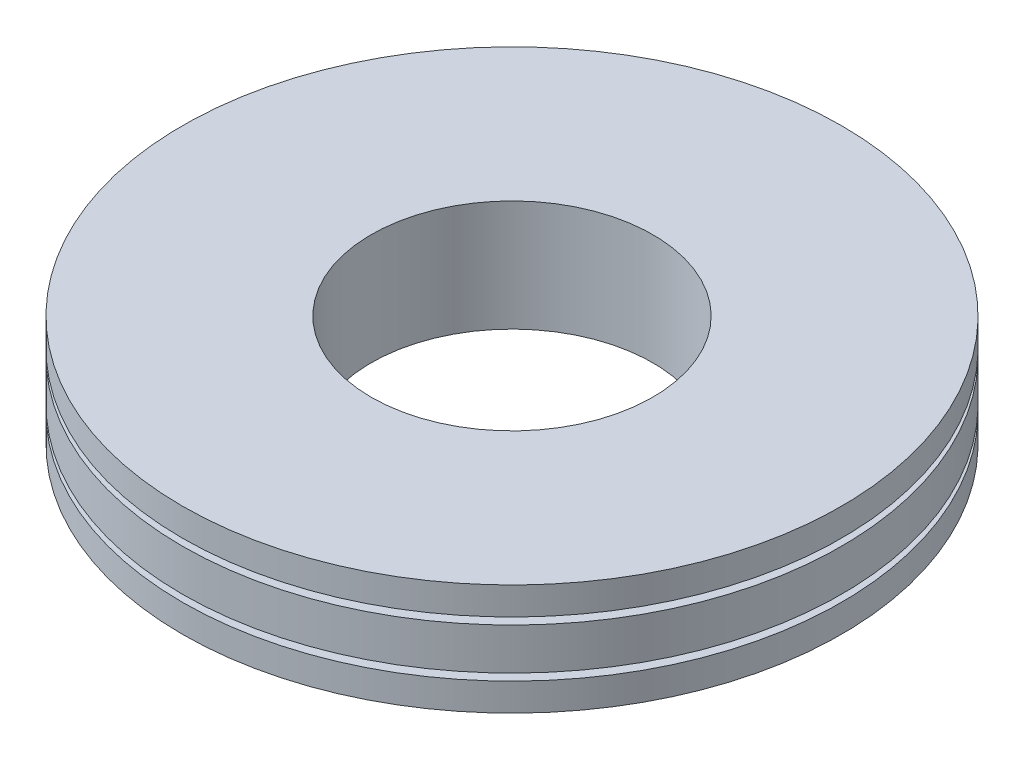
ISO-10303-21;
HEADER;
FILE_DESCRIPTION(('STEP AP214'),'2;1');
FILE_NAME('part.step','',(''),(''),'','','');
FILE_SCHEMA(('AUTOMOTIVE_DESIGN { 1 0 10303 214 1 1 1 1 }'));
ENDSEC;
DATA;
#1=APPLICATION_CONTEXT('core data for automotive mechanical design processes');
#2=APPLICATION_PROTOCOL_DEFINITION('international standard','automotive_design',2000,#1);
#3=PRODUCT_CONTEXT('',#1,'mechanical');
#4=PRODUCT('Part','Part','',(#3));
#5=PRODUCT_RELATED_PRODUCT_CATEGORY('part','',(#4));
#6=PRODUCT_DEFINITION_FORMATION('','',#4);
#7=PRODUCT_DEFINITION_CONTEXT('part definition',#1,'design');
#8=PRODUCT_DEFINITION('design','',#6,#7);
#9=PRODUCT_DEFINITION_SHAPE('','',#8);
#10=(LENGTH_UNIT() NAMED_UNIT(*) SI_UNIT(.MILLI.,.METRE.));
#11=(NAMED_UNIT(*) PLANE_ANGLE_UNIT() SI_UNIT($,.RADIAN.));
#12=(NAMED_UNIT(*) SI_UNIT($,.STERADIAN.) SOLID_ANGLE_UNIT());
#13=UNCERTAINTY_MEASURE_WITH_UNIT(LENGTH_MEASURE(1.E-05),#10,'distance_accuracy_value','');
#14=(GEOMETRIC_REPRESENTATION_CONTEXT(3) GLOBAL_UNCERTAINTY_ASSIGNED_CONTEXT((#13)) GLOBAL_UNIT_ASSIGNED_CONTEXT((#10,
#11,#12)) REPRESENTATION_CONTEXT('',''));
#15=CARTESIAN_POINT('',(0.,0.,0.));
#16=DIRECTION('',(0.,0.,1.));
#17=DIRECTION('',(1.,0.,0.));
#18=AXIS2_PLACEMENT_3D('',#15,#16,#17);
#19=CARTESIAN_POINT('',(0.,2.,0.));
#20=DIRECTION('',(0.,-1.,0.));
#21=DIRECTION('',(0.,0.,-1.));
#22=AXIS2_PLACEMENT_3D('',#19,#20,#21);
#23=CYLINDRICAL_SURFACE('',#22,11.875);
#24=CARTESIAN_POINT('',(0.,0.75,0.));
#25=DIRECTION('',(0.,1.,0.));
#26=DIRECTION('',(0.,0.,1.));
#27=AXIS2_PLACEMENT_3D('',#24,#25,#26);
#28=CIRCLE('',#27,11.875);
#29=CARTESIAN_POINT('',(0.,0.75,11.875));
#30=VERTEX_POINT('',#29);
#31=EDGE_CURVE('E51',#30,#30,#28,.T.);
#32=ORIENTED_EDGE('',*,*,#31,.F.);
#33=EDGE_LOOP('',(#32));
#34=FACE_BOUND('',#33,.T.);
#35=CARTESIAN_POINT('',(0.,-0.75,0.));
#36=DIRECTION('',(0.,1.,0.));
#37=DIRECTION('',(0.,0.,1.));
#38=AXIS2_PLACEMENT_3D('',#35,#36,#37);
#39=CIRCLE('',#38,11.875);
#40=CARTESIAN_POINT('',(0.,-0.75,11.875));
#41=VERTEX_POINT('',#40);
#42=EDGE_CURVE('E63',#41,#41,#39,.T.);
#43=ORIENTED_EDGE('',*,*,#42,.T.);
#44=EDGE_LOOP('',(#43));
#45=FACE_BOUND('',#44,.T.);
#46=ADVANCED_FACE('F35',(#34,#45),#23,.T.);
#47=CARTESIAN_POINT('',(0.,-1.,0.));
#48=DIRECTION('',(0.,1.,0.));
#49=DIRECTION('',(0.,0.,1.));
#50=AXIS2_PLACEMENT_3D('',#47,#48,#49);
#51=CIRCLE('',#50,11.875);
#52=CARTESIAN_POINT('',(0.,-1.,11.875));
#53=VERTEX_POINT('',#52);
#54=EDGE_CURVE('E66',#53,#53,#51,.T.);
#55=ORIENTED_EDGE('',*,*,#54,.F.);
#56=EDGE_LOOP('',(#55));
#57=FACE_BOUND('',#56,.T.);
#58=CARTESIAN_POINT('',(0.,-2.,0.));
#59=DIRECTION('',(0.,1.,0.));
#60=DIRECTION('',(0.,0.,1.));
#61=AXIS2_PLACEMENT_3D('',#58,#59,#60);
#62=CIRCLE('',#61,11.875);
#63=CARTESIAN_POINT('',(0.,-2.,11.875));
#64=VERTEX_POINT('',#63);
#65=EDGE_CURVE('E39',#64,#64,#62,.T.);
#66=ORIENTED_EDGE('',*,*,#65,.T.);
#67=EDGE_LOOP('',(#66));
#68=FACE_BOUND('',#67,.T.);
#69=ADVANCED_FACE('F98',(#57,#68),#23,.T.);
#70=CARTESIAN_POINT('',(0.,2.,0.));
#71=DIRECTION('',(0.,1.,0.));
#72=DIRECTION('',(0.,0.,1.));
#73=AXIS2_PLACEMENT_3D('',#70,#71,#72);
#74=PLANE('',#73);
#75=CARTESIAN_POINT('',(0.,2.,0.));
#76=DIRECTION('',(0.,1.,0.));
#77=DIRECTION('',(0.,0.,1.));
#78=AXIS2_PLACEMENT_3D('',#75,#76,#77);
#79=CIRCLE('',#78,11.875);
#80=CARTESIAN_POINT('',(0.,2.,11.875));
#81=VERTEX_POINT('',#80);
#82=EDGE_CURVE('E10',#81,#81,#79,.T.);
#83=ORIENTED_EDGE('',*,*,#82,.T.);
#84=EDGE_LOOP('',(#83));
#85=FACE_BOUND('',#84,.T.);
#86=CARTESIAN_POINT('',(0.,2.,0.));
#87=DIRECTION('',(0.,1.,0.));
#88=DIRECTION('',(0.,0.,1.));
#89=AXIS2_PLACEMENT_3D('',#86,#87,#88);
#90=CIRCLE('',#89,5.075);
#91=CARTESIAN_POINT('',(0.,2.,5.075));
#92=VERTEX_POINT('',#91);
#93=EDGE_CURVE('E46',#92,#92,#90,.T.);
#94=ORIENTED_EDGE('',*,*,#93,.F.);
#95=EDGE_LOOP('',(#94));
#96=FACE_BOUND('',#95,.T.);
#97=ADVANCED_FACE('F103',(#85,#96),#74,.T.);
#98=CARTESIAN_POINT('',(0.,-2.,0.));
#99=DIRECTION('',(0.,1.,0.));
#100=DIRECTION('',(0.,0.,1.));
#101=AXIS2_PLACEMENT_3D('',#98,#99,#100);
#102=PLANE('',#101);
#103=ORIENTED_EDGE('',*,*,#65,.F.);
#104=EDGE_LOOP('',(#103));
#105=FACE_BOUND('',#104,.T.);
#106=CARTESIAN_POINT('',(0.,-2.,0.));
#107=DIRECTION('',(0.,1.,0.));
#108=DIRECTION('',(0.,0.,1.));
#109=AXIS2_PLACEMENT_3D('',#106,#107,#108);
#110=CIRCLE('',#109,5.075);
#111=CARTESIAN_POINT('',(0.,-2.,5.075));
#112=VERTEX_POINT('',#111);
#113=EDGE_CURVE('E48',#112,#112,#110,.T.);
#114=ORIENTED_EDGE('',*,*,#113,.T.);
#115=EDGE_LOOP('',(#114));
#116=FACE_BOUND('',#115,.T.);
#117=ADVANCED_FACE('F109',(#105,#116),#102,.F.);
#118=CARTESIAN_POINT('',(0.,1.,0.));
#119=DIRECTION('',(0.,1.,0.));
#120=DIRECTION('',(0.,0.,1.));
#121=AXIS2_PLACEMENT_3D('',#118,#119,#120);
#122=CIRCLE('',#121,11.875);
#123=CARTESIAN_POINT('',(0.,1.,11.875));
#124=VERTEX_POINT('',#123);
#125=EDGE_CURVE('E54',#124,#124,#122,.T.);
#126=ORIENTED_EDGE('',*,*,#125,.T.);
#127=EDGE_LOOP('',(#126));
#128=FACE_BOUND('',#127,.T.);
#129=ORIENTED_EDGE('',*,*,#82,.F.);
#130=EDGE_LOOP('',(#129));
#131=FACE_BOUND('',#130,.T.);
#132=ADVANCED_FACE('F37',(#128,#131),#23,.T.);
#133=CARTESIAN_POINT('',(0.,2.,0.));
#134=DIRECTION('',(0.,-1.,0.));
#135=DIRECTION('',(0.,0.,-1.));
#136=AXIS2_PLACEMENT_3D('',#133,#134,#135);
#137=CYLINDRICAL_SURFACE('',#136,5.075);
#138=ORIENTED_EDGE('',*,*,#93,.T.);
#139=EDGE_LOOP('',(#138));
#140=FACE_BOUND('',#139,.T.);
#141=ORIENTED_EDGE('',*,*,#113,.F.);
#142=EDGE_LOOP('',(#141));
#143=FACE_BOUND('',#142,.T.);
#144=ADVANCED_FACE('F108',(#140,#143),#137,.F.);
#145=CARTESIAN_POINT('',(0.,0.75,0.));
#146=DIRECTION('',(0.,1.,0.));
#147=DIRECTION('',(0.,0.,1.));
#148=AXIS2_PLACEMENT_3D('',#145,#146,#147);
#149=PLANE('',#148);
#150=CARTESIAN_POINT('',(0.,0.75,0.));
#151=DIRECTION('',(0.,1.,0.));
#152=DIRECTION('',(0.,0.,1.));
#153=AXIS2_PLACEMENT_3D('',#150,#151,#152);
#154=CIRCLE('',#153,11.375);
#155=CARTESIAN_POINT('',(0.,0.75,11.375));
#156=VERTEX_POINT('',#155);
#157=EDGE_CURVE('E57',#156,#156,#154,.T.);
#158=ORIENTED_EDGE('',*,*,#157,.F.);
#159=EDGE_LOOP('',(#158));
#160=FACE_BOUND('',#159,.T.);
#161=ORIENTED_EDGE('',*,*,#31,.T.);
#162=EDGE_LOOP('',(#161));
#163=FACE_BOUND('',#162,.T.);
#164=ADVANCED_FACE('F115',(#160,#163),#149,.T.);
#165=CARTESIAN_POINT('',(0.,1.,0.));
#166=DIRECTION('',(0.,1.,0.));
#167=DIRECTION('',(0.,0.,1.));
#168=AXIS2_PLACEMENT_3D('',#165,#166,#167);
#169=PLANE('',#168);
#170=CARTESIAN_POINT('',(0.,1.,0.));
#171=DIRECTION('',(0.,1.,0.));
#172=DIRECTION('',(0.,0.,1.));
#173=AXIS2_PLACEMENT_3D('',#170,#171,#172);
#174=CIRCLE('',#173,11.375);
#175=CARTESIAN_POINT('',(0.,1.,11.375));
#176=VERTEX_POINT('',#175);
#177=EDGE_CURVE('E60',#176,#176,#174,.T.);
#178=ORIENTED_EDGE('',*,*,#177,.T.);
#179=EDGE_LOOP('',(#178));
#180=FACE_BOUND('',#179,.T.);
#181=ORIENTED_EDGE('',*,*,#125,.F.);
#182=EDGE_LOOP('',(#181));
#183=FACE_BOUND('',#182,.T.);
#184=ADVANCED_FACE('F122',(#180,#183),#169,.F.);
#185=CARTESIAN_POINT('',(0.,0.75,0.));
#186=DIRECTION('',(0.,1.,0.));
#187=DIRECTION('',(0.,0.,1.));
#188=AXIS2_PLACEMENT_3D('',#185,#186,#187);
#189=CYLINDRICAL_SURFACE('',#188,11.375);
#190=ORIENTED_EDGE('',*,*,#157,.T.);
#191=EDGE_LOOP('',(#190));
#192=FACE_BOUND('',#191,.T.);
#193=ORIENTED_EDGE('',*,*,#177,.F.);
#194=EDGE_LOOP('',(#193));
#195=FACE_BOUND('',#194,.T.);
#196=ADVANCED_FACE('F93',(#192,#195),#189,.T.);
#197=CARTESIAN_POINT('',(0.,-0.75,0.));
#198=DIRECTION('',(0.,-1.,0.));
#199=DIRECTION('',(0.,0.,1.));
#200=AXIS2_PLACEMENT_3D('',#197,#198,#199);
#201=PLANE('',#200);
#202=ORIENTED_EDGE('',*,*,#42,.F.);
#203=EDGE_LOOP('',(#202));
#204=FACE_BOUND('',#203,.T.);
#205=CARTESIAN_POINT('',(0.,-0.75,0.));
#206=DIRECTION('',(0.,1.,0.));
#207=DIRECTION('',(0.,0.,1.));
#208=AXIS2_PLACEMENT_3D('',#205,#206,#207);
#209=CIRCLE('',#208,11.375);
#210=CARTESIAN_POINT('',(0.,-0.75,11.375));
#211=VERTEX_POINT('',#210);
#212=EDGE_CURVE('E69',#211,#211,#209,.T.);
#213=ORIENTED_EDGE('',*,*,#212,.T.);
#214=EDGE_LOOP('',(#213));
#215=FACE_BOUND('',#214,.T.);
#216=ADVANCED_FACE('F78',(#204,#215),#201,.T.);
#217=CARTESIAN_POINT('',(0.,-1.,0.));
#218=DIRECTION('',(0.,-1.,0.));
#219=DIRECTION('',(0.,0.,1.));
#220=AXIS2_PLACEMENT_3D('',#217,#218,#219);
#221=PLANE('',#220);
#222=ORIENTED_EDGE('',*,*,#54,.T.);
#223=EDGE_LOOP('',(#222));
#224=FACE_BOUND('',#223,.T.);
#225=CARTESIAN_POINT('',(0.,-1.,0.));
#226=DIRECTION('',(0.,1.,0.));
#227=DIRECTION('',(0.,0.,1.));
#228=AXIS2_PLACEMENT_3D('',#225,#226,#227);
#229=CIRCLE('',#228,11.375);
#230=CARTESIAN_POINT('',(0.,-1.,11.375));
#231=VERTEX_POINT('',#230);
#232=EDGE_CURVE('E72',#231,#231,#229,.T.);
#233=ORIENTED_EDGE('',*,*,#232,.F.);
#234=EDGE_LOOP('',(#233));
#235=FACE_BOUND('',#234,.T.);
#236=ADVANCED_FACE('F83',(#224,#235),#221,.F.);
#237=CARTESIAN_POINT('',(0.,-0.75,0.));
#238=DIRECTION('',(0.,-1.,0.));
#239=DIRECTION('',(0.,0.,-1.));
#240=AXIS2_PLACEMENT_3D('',#237,#238,#239);
#241=CYLINDRICAL_SURFACE('',#240,11.375);
#242=ORIENTED_EDGE('',*,*,#212,.F.);
#243=EDGE_LOOP('',(#242));
#244=FACE_BOUND('',#243,.T.);
#245=ORIENTED_EDGE('',*,*,#232,.T.);
#246=EDGE_LOOP('',(#245));
#247=FACE_BOUND('',#246,.T.);
#248=ADVANCED_FACE('F80',(#244,#247),#241,.T.);
#249=CLOSED_SHELL('',(#46,#69,#97,#117,#132,#144,#164,#184,#196,#216,#236,#248));
#250=MANIFOLD_SOLID_BREP('B2',#249);
#251=ADVANCED_BREP_SHAPE_REPRESENTATION('',(#18,#250),#14);
#252=SHAPE_DEFINITION_REPRESENTATION(#9,#251);
ENDSEC;
END-ISO-10303-21;
